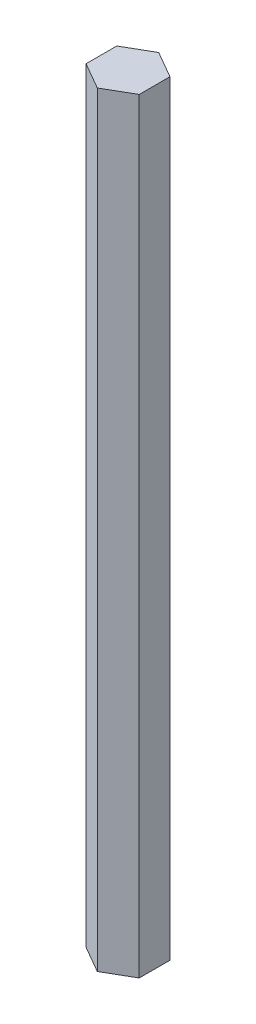
ISO-10303-21;
HEADER;
FILE_DESCRIPTION(('STEP AP214'),'2;1');
FILE_NAME('part.step','',(''),(''),'','','');
FILE_SCHEMA(('AUTOMOTIVE_DESIGN { 1 0 10303 214 1 1 1 1 }'));
ENDSEC;
DATA;
#1=APPLICATION_CONTEXT('core data for automotive mechanical design processes');
#2=APPLICATION_PROTOCOL_DEFINITION('international standard','automotive_design',2000,#1);
#3=PRODUCT_CONTEXT('',#1,'mechanical');
#4=PRODUCT('Part','Part','',(#3));
#5=PRODUCT_RELATED_PRODUCT_CATEGORY('part','',(#4));
#6=PRODUCT_DEFINITION_FORMATION('','',#4);
#7=PRODUCT_DEFINITION_CONTEXT('part definition',#1,'design');
#8=PRODUCT_DEFINITION('design','',#6,#7);
#9=PRODUCT_DEFINITION_SHAPE('','',#8);
#10=(LENGTH_UNIT() NAMED_UNIT(*) SI_UNIT(.MILLI.,.METRE.));
#11=(NAMED_UNIT(*) PLANE_ANGLE_UNIT() SI_UNIT($,.RADIAN.));
#12=(NAMED_UNIT(*) SI_UNIT($,.STERADIAN.) SOLID_ANGLE_UNIT());
#13=UNCERTAINTY_MEASURE_WITH_UNIT(LENGTH_MEASURE(1.E-05),#10,'distance_accuracy_value','');
#14=(GEOMETRIC_REPRESENTATION_CONTEXT(3) GLOBAL_UNCERTAINTY_ASSIGNED_CONTEXT((#13)) GLOBAL_UNIT_ASSIGNED_CONTEXT((#10,
#11,#12)) REPRESENTATION_CONTEXT('',''));
#15=CARTESIAN_POINT('',(0.,0.,0.));
#16=DIRECTION('',(0.,0.,1.));
#17=DIRECTION('',(1.,0.,0.));
#18=AXIS2_PLACEMENT_3D('',#15,#16,#17);
#19=CARTESIAN_POINT('',(0.,0.,0.));
#20=DIRECTION('',(0.,1.,0.));
#21=DIRECTION('',(0.,0.,1.));
#22=AXIS2_PLACEMENT_3D('',#19,#20,#21);
#23=PLANE('',#22);
#24=DIRECTION('',(-0.866025403784439,0.,0.5));
#25=VECTOR('',#24,1.);
#26=CARTESIAN_POINT('',(-2.63964543073497,0.,-4.572));
#27=LINE('',#26,#25);
#28=CARTESIAN_POINT('',(0.,0.,-6.096));
#29=VERTEX_POINT('',#28);
#30=CARTESIAN_POINT('',(-5.27929086146994,0.,-3.048));
#31=VERTEX_POINT('',#30);
#32=EDGE_CURVE('E131',#29,#31,#27,.T.);
#33=ORIENTED_EDGE('',*,*,#32,.F.);
#34=DIRECTION('',(-0.866025403784439,0.,-0.5));
#35=VECTOR('',#34,1.);
#36=CARTESIAN_POINT('',(2.63964543073497,0.,-4.572));
#37=LINE('',#36,#35);
#38=CARTESIAN_POINT('',(5.27929086146994,0.,-3.048));
#39=VERTEX_POINT('',#38);
#40=EDGE_CURVE('E85',#39,#29,#37,.T.);
#41=ORIENTED_EDGE('',*,*,#40,.F.);
#42=DIRECTION('',(0.,0.,-1.));
#43=VECTOR('',#42,1.);
#44=CARTESIAN_POINT('',(5.27929086146994,0.,0.));
#45=LINE('',#44,#43);
#46=CARTESIAN_POINT('',(5.27929086146994,0.,3.048));
#47=VERTEX_POINT('',#46);
#48=EDGE_CURVE('E140',#47,#39,#45,.T.);
#49=ORIENTED_EDGE('',*,*,#48,.F.);
#50=DIRECTION('',(0.866025403784439,0.,-0.5));
#51=VECTOR('',#50,1.);
#52=CARTESIAN_POINT('',(2.63964543073497,0.,4.572));
#53=LINE('',#52,#51);
#54=CARTESIAN_POINT('',(0.,0.,6.096));
#55=VERTEX_POINT('',#54);
#56=EDGE_CURVE('E119',#55,#47,#53,.T.);
#57=ORIENTED_EDGE('',*,*,#56,.F.);
#58=DIRECTION('',(0.866025403784439,0.,0.5));
#59=VECTOR('',#58,1.);
#60=CARTESIAN_POINT('',(-2.63964543073497,0.,4.572));
#61=LINE('',#60,#59);
#62=CARTESIAN_POINT('',(-5.27929086146994,0.,3.048));
#63=VERTEX_POINT('',#62);
#64=EDGE_CURVE('E137',#63,#55,#61,.T.);
#65=ORIENTED_EDGE('',*,*,#64,.F.);
#66=DIRECTION('',(0.,0.,1.));
#67=VECTOR('',#66,1.);
#68=CARTESIAN_POINT('',(-5.27929086146994,0.,0.));
#69=LINE('',#68,#67);
#70=EDGE_CURVE('E134',#31,#63,#69,.T.);
#71=ORIENTED_EDGE('',*,*,#70,.F.);
#72=EDGE_LOOP('',(#33,#41,#49,#57,#65,#71));
#73=FACE_BOUND('',#72,.T.);
#74=CARTESIAN_POINT('',(0.,0.,0.));
#75=DIRECTION('',(0.,1.,0.));
#76=DIRECTION('',(0.,0.,1.));
#77=AXIS2_PLACEMENT_3D('',#74,#75,#76);
#78=CIRCLE('',#77,2.7305);
#79=CARTESIAN_POINT('',(2.,0.,-1.85893255660338));
#80=VERTEX_POINT('',#79);
#81=CARTESIAN_POINT('',(2.,0.,1.85893255660338));
#82=VERTEX_POINT('',#81);
#83=EDGE_CURVE('E49',#80,#82,#78,.T.);
#84=ORIENTED_EDGE('',*,*,#83,.T.);
#85=DIRECTION('',(0.,0.,-1.));
#86=VECTOR('',#85,1.);
#87=CARTESIAN_POINT('',(2.,0.,1.85893255660338));
#88=LINE('',#87,#86);
#89=EDGE_CURVE('E164',#82,#80,#88,.T.);
#90=ORIENTED_EDGE('',*,*,#89,.T.);
#91=EDGE_LOOP('',(#84,#90));
#92=FACE_BOUND('',#91,.T.);
#93=ADVANCED_FACE('F34',(#73,#92),#23,.F.);
#94=CARTESIAN_POINT('',(-2.63964543073497,151.892,-4.572));
#95=DIRECTION('',(0.5,0.,0.866025403784439));
#96=DIRECTION('',(0.866025403784439,0.,-0.5));
#97=AXIS2_PLACEMENT_3D('',#94,#95,#96);
#98=PLANE('',#97);
#99=ORIENTED_EDGE('',*,*,#32,.T.);
#100=DIRECTION('',(0.,-1.,0.));
#101=VECTOR('',#100,1.);
#102=CARTESIAN_POINT('',(-5.27929086146994,151.892,-3.048));
#103=LINE('',#102,#101);
#104=CARTESIAN_POINT('',(-5.27929086146994,151.892,-3.048));
#105=VERTEX_POINT('',#104);
#106=EDGE_CURVE('E11',#105,#31,#103,.T.);
#107=ORIENTED_EDGE('',*,*,#106,.F.);
#108=DIRECTION('',(-0.866025403784439,0.,0.5));
#109=VECTOR('',#108,1.);
#110=CARTESIAN_POINT('',(-2.63964543073497,151.892,-4.572));
#111=LINE('',#110,#109);
#112=CARTESIAN_POINT('',(0.,151.892,-6.096));
#113=VERTEX_POINT('',#112);
#114=EDGE_CURVE('E143',#113,#105,#111,.T.);
#115=ORIENTED_EDGE('',*,*,#114,.F.);
#116=DIRECTION('',(0.,-1.,0.));
#117=VECTOR('',#116,1.);
#118=CARTESIAN_POINT('',(0.,151.892,-6.096));
#119=LINE('',#118,#117);
#120=EDGE_CURVE('E127',#113,#29,#119,.T.);
#121=ORIENTED_EDGE('',*,*,#120,.T.);
#122=EDGE_LOOP('',(#99,#107,#115,#121));
#123=FACE_BOUND('',#122,.T.);
#124=ADVANCED_FACE('F36',(#123),#98,.F.);
#125=CARTESIAN_POINT('',(-5.27929086146994,151.892,0.));
#126=DIRECTION('',(1.,0.,0.));
#127=DIRECTION('',(0.,0.,-1.));
#128=AXIS2_PLACEMENT_3D('',#125,#126,#127);
#129=PLANE('',#128);
#130=ORIENTED_EDGE('',*,*,#70,.T.);
#131=DIRECTION('',(0.,-1.,0.));
#132=VECTOR('',#131,1.);
#133=CARTESIAN_POINT('',(-5.27929086146994,151.892,3.048));
#134=LINE('',#133,#132);
#135=CARTESIAN_POINT('',(-5.27929086146994,151.892,3.048));
#136=VERTEX_POINT('',#135);
#137=EDGE_CURVE('E42',#136,#63,#134,.T.);
#138=ORIENTED_EDGE('',*,*,#137,.F.);
#139=DIRECTION('',(0.,0.,1.));
#140=VECTOR('',#139,1.);
#141=CARTESIAN_POINT('',(-5.27929086146994,151.892,0.));
#142=LINE('',#141,#140);
#143=EDGE_CURVE('E93',#105,#136,#142,.T.);
#144=ORIENTED_EDGE('',*,*,#143,.F.);
#145=ORIENTED_EDGE('',*,*,#106,.T.);
#146=EDGE_LOOP('',(#130,#138,#144,#145));
#147=FACE_BOUND('',#146,.T.);
#148=ADVANCED_FACE('F187',(#147),#129,.F.);
#149=CARTESIAN_POINT('',(-2.63964543073497,151.892,4.572));
#150=DIRECTION('',(0.5,0.,-0.866025403784439));
#151=DIRECTION('',(-0.866025403784439,0.,-0.5));
#152=AXIS2_PLACEMENT_3D('',#149,#150,#151);
#153=PLANE('',#152);
#154=ORIENTED_EDGE('',*,*,#64,.T.);
#155=DIRECTION('',(0.,-1.,0.));
#156=VECTOR('',#155,1.);
#157=CARTESIAN_POINT('',(0.,151.892,6.096));
#158=LINE('',#157,#156);
#159=CARTESIAN_POINT('',(0.,151.892,6.096));
#160=VERTEX_POINT('',#159);
#161=EDGE_CURVE('E122',#160,#55,#158,.T.);
#162=ORIENTED_EDGE('',*,*,#161,.F.);
#163=DIRECTION('',(0.866025403784439,0.,0.5));
#164=VECTOR('',#163,1.);
#165=CARTESIAN_POINT('',(-2.63964543073497,151.892,4.572));
#166=LINE('',#165,#164);
#167=EDGE_CURVE('E110',#136,#160,#166,.T.);
#168=ORIENTED_EDGE('',*,*,#167,.F.);
#169=ORIENTED_EDGE('',*,*,#137,.T.);
#170=EDGE_LOOP('',(#154,#162,#168,#169));
#171=FACE_BOUND('',#170,.T.);
#172=ADVANCED_FACE('F149',(#171),#153,.F.);
#173=CARTESIAN_POINT('',(2.63964543073497,151.892,4.572));
#174=DIRECTION('',(-0.5,0.,-0.866025403784438));
#175=DIRECTION('',(-0.866025403784439,0.,0.5));
#176=AXIS2_PLACEMENT_3D('',#173,#174,#175);
#177=PLANE('',#176);
#178=ORIENTED_EDGE('',*,*,#56,.T.);
#179=DIRECTION('',(0.,-1.,0.));
#180=VECTOR('',#179,1.);
#181=CARTESIAN_POINT('',(5.27929086146994,151.892,3.048));
#182=LINE('',#181,#180);
#183=CARTESIAN_POINT('',(5.27929086146994,151.892,3.048));
#184=VERTEX_POINT('',#183);
#185=EDGE_CURVE('E116',#184,#47,#182,.T.);
#186=ORIENTED_EDGE('',*,*,#185,.F.);
#187=DIRECTION('',(0.866025403784439,0.,-0.5));
#188=VECTOR('',#187,1.);
#189=CARTESIAN_POINT('',(2.63964543073497,151.892,4.572));
#190=LINE('',#189,#188);
#191=EDGE_CURVE('E103',#160,#184,#190,.T.);
#192=ORIENTED_EDGE('',*,*,#191,.F.);
#193=ORIENTED_EDGE('',*,*,#161,.T.);
#194=EDGE_LOOP('',(#178,#186,#192,#193));
#195=FACE_BOUND('',#194,.T.);
#196=ADVANCED_FACE('F117',(#195),#177,.F.);
#197=CARTESIAN_POINT('',(5.27929086146994,151.892,0.));
#198=DIRECTION('',(-1.,0.,0.));
#199=DIRECTION('',(0.,0.,1.));
#200=AXIS2_PLACEMENT_3D('',#197,#198,#199);
#201=PLANE('',#200);
#202=ORIENTED_EDGE('',*,*,#48,.T.);
#203=DIRECTION('',(0.,-1.,0.));
#204=VECTOR('',#203,1.);
#205=CARTESIAN_POINT('',(5.27929086146994,151.892,-3.048));
#206=LINE('',#205,#204);
#207=CARTESIAN_POINT('',(5.27929086146994,151.892,-3.048));
#208=VERTEX_POINT('',#207);
#209=EDGE_CURVE('E123',#208,#39,#206,.T.);
#210=ORIENTED_EDGE('',*,*,#209,.F.);
#211=DIRECTION('',(0.,0.,-1.));
#212=VECTOR('',#211,1.);
#213=CARTESIAN_POINT('',(5.27929086146994,151.892,0.));
#214=LINE('',#213,#212);
#215=EDGE_CURVE('E107',#184,#208,#214,.T.);
#216=ORIENTED_EDGE('',*,*,#215,.F.);
#217=ORIENTED_EDGE('',*,*,#185,.T.);
#218=EDGE_LOOP('',(#202,#210,#216,#217));
#219=FACE_BOUND('',#218,.T.);
#220=ADVANCED_FACE('F125',(#219),#201,.F.);
#221=CARTESIAN_POINT('',(2.63964543073497,151.892,-4.572));
#222=DIRECTION('',(-0.5,0.,0.866025403784439));
#223=DIRECTION('',(0.866025403784439,0.,0.5));
#224=AXIS2_PLACEMENT_3D('',#221,#222,#223);
#225=PLANE('',#224);
#226=ORIENTED_EDGE('',*,*,#40,.T.);
#227=ORIENTED_EDGE('',*,*,#120,.F.);
#228=DIRECTION('',(-0.866025403784439,0.,-0.5));
#229=VECTOR('',#228,1.);
#230=CARTESIAN_POINT('',(2.63964543073497,151.892,-4.572));
#231=LINE('',#230,#229);
#232=EDGE_CURVE('E58',#208,#113,#231,.T.);
#233=ORIENTED_EDGE('',*,*,#232,.F.);
#234=ORIENTED_EDGE('',*,*,#209,.T.);
#235=EDGE_LOOP('',(#226,#227,#233,#234));
#236=FACE_BOUND('',#235,.T.);
#237=ADVANCED_FACE('F153',(#236),#225,.F.);
#238=CARTESIAN_POINT('',(0.,151.892,0.));
#239=DIRECTION('',(0.,1.,0.));
#240=DIRECTION('',(0.,0.,1.));
#241=AXIS2_PLACEMENT_3D('',#238,#239,#240);
#242=PLANE('',#241);
#243=ORIENTED_EDGE('',*,*,#114,.T.);
#244=ORIENTED_EDGE('',*,*,#143,.T.);
#245=ORIENTED_EDGE('',*,*,#167,.T.);
#246=ORIENTED_EDGE('',*,*,#191,.T.);
#247=ORIENTED_EDGE('',*,*,#215,.T.);
#248=ORIENTED_EDGE('',*,*,#232,.T.);
#249=EDGE_LOOP('',(#243,#244,#245,#246,#247,#248));
#250=FACE_BOUND('',#249,.T.);
#251=ADVANCED_FACE('F105',(#250),#242,.T.);
#252=CARTESIAN_POINT('',(0.,10.16,0.));
#253=DIRECTION('',(0.,-1.,0.));
#254=DIRECTION('',(0.,0.,-1.));
#255=AXIS2_PLACEMENT_3D('',#252,#253,#254);
#256=CYLINDRICAL_SURFACE('',#255,2.7305);
#257=ORIENTED_EDGE('',*,*,#83,.F.);
#258=DIRECTION('',(0.,-1.,0.));
#259=VECTOR('',#258,1.);
#260=CARTESIAN_POINT('',(2.,10.16,-1.85893255660338));
#261=LINE('',#260,#259);
#262=CARTESIAN_POINT('',(2.,10.16,-1.85893255660338));
#263=VERTEX_POINT('',#262);
#264=EDGE_CURVE('E161',#263,#80,#261,.T.);
#265=ORIENTED_EDGE('',*,*,#264,.F.);
#266=CARTESIAN_POINT('',(0.,10.16,0.));
#267=DIRECTION('',(0.,1.,0.));
#268=DIRECTION('',(0.,0.,1.));
#269=AXIS2_PLACEMENT_3D('',#266,#267,#268);
#270=CIRCLE('',#269,2.7305);
#271=CARTESIAN_POINT('',(2.,10.16,1.85893255660338));
#272=VERTEX_POINT('',#271);
#273=EDGE_CURVE('E167',#263,#272,#270,.T.);
#274=ORIENTED_EDGE('',*,*,#273,.T.);
#275=DIRECTION('',(0.,-1.,0.));
#276=VECTOR('',#275,1.);
#277=CARTESIAN_POINT('',(2.,10.16,1.85893255660338));
#278=LINE('',#277,#276);
#279=EDGE_CURVE('E135',#272,#82,#278,.T.);
#280=ORIENTED_EDGE('',*,*,#279,.T.);
#281=EDGE_LOOP('',(#257,#265,#274,#280));
#282=FACE_BOUND('',#281,.T.);
#283=ADVANCED_FACE('F175',(#282),#256,.F.);
#284=CARTESIAN_POINT('',(2.,10.16,1.85893255660338));
#285=DIRECTION('',(-1.,0.,0.));
#286=DIRECTION('',(0.,0.,1.));
#287=AXIS2_PLACEMENT_3D('',#284,#285,#286);
#288=PLANE('',#287);
#289=ORIENTED_EDGE('',*,*,#89,.F.);
#290=ORIENTED_EDGE('',*,*,#279,.F.);
#291=DIRECTION('',(0.,0.,-1.));
#292=VECTOR('',#291,1.);
#293=CARTESIAN_POINT('',(2.,10.16,1.85893255660338));
#294=LINE('',#293,#292);
#295=EDGE_CURVE('E163',#272,#263,#294,.T.);
#296=ORIENTED_EDGE('',*,*,#295,.T.);
#297=ORIENTED_EDGE('',*,*,#264,.T.);
#298=EDGE_LOOP('',(#289,#290,#296,#297));
#299=FACE_BOUND('',#298,.T.);
#300=ADVANCED_FACE('F181',(#299),#288,.T.);
#301=CARTESIAN_POINT('',(0.,10.16,0.));
#302=DIRECTION('',(0.,1.,0.));
#303=DIRECTION('',(0.,0.,1.));
#304=AXIS2_PLACEMENT_3D('',#301,#302,#303);
#305=PLANE('',#304);
#306=ORIENTED_EDGE('',*,*,#273,.F.);
#307=ORIENTED_EDGE('',*,*,#295,.F.);
#308=EDGE_LOOP('',(#306,#307));
#309=FACE_BOUND('',#308,.T.);
#310=ADVANCED_FACE('F235',(#309),#305,.F.);
#311=CLOSED_SHELL('',(#93,#124,#148,#172,#196,#220,#237,#251,#283,#300,#310));
#312=MANIFOLD_SOLID_BREP('B2',#311);
#313=ADVANCED_BREP_SHAPE_REPRESENTATION('',(#18,#312),#14);
#314=SHAPE_DEFINITION_REPRESENTATION(#9,#313);
ENDSEC;
END-ISO-10303-21;
